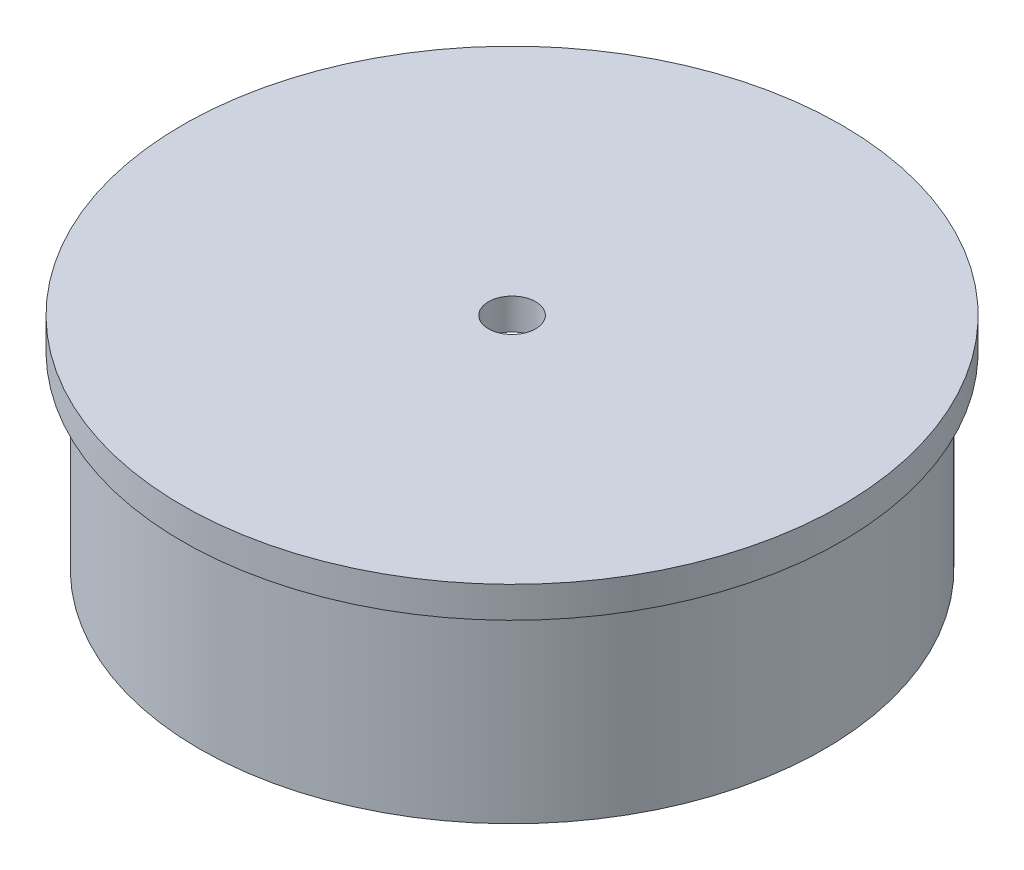
ISO-10303-21;
HEADER;
FILE_DESCRIPTION(('STEP AP214'),'2;1');
FILE_NAME('part.step','',(''),(''),'','','');
FILE_SCHEMA(('AUTOMOTIVE_DESIGN { 1 0 10303 214 1 1 1 1 }'));
ENDSEC;
DATA;
#1=APPLICATION_CONTEXT('core data for automotive mechanical design processes');
#2=APPLICATION_PROTOCOL_DEFINITION('international standard','automotive_design',2000,#1);
#3=PRODUCT_CONTEXT('',#1,'mechanical');
#4=PRODUCT('Part','Part','',(#3));
#5=PRODUCT_RELATED_PRODUCT_CATEGORY('part','',(#4));
#6=PRODUCT_DEFINITION_FORMATION('','',#4);
#7=PRODUCT_DEFINITION_CONTEXT('part definition',#1,'design');
#8=PRODUCT_DEFINITION('design','',#6,#7);
#9=PRODUCT_DEFINITION_SHAPE('','',#8);
#10=(LENGTH_UNIT() NAMED_UNIT(*) SI_UNIT(.MILLI.,.METRE.));
#11=(NAMED_UNIT(*) PLANE_ANGLE_UNIT() SI_UNIT($,.RADIAN.));
#12=(NAMED_UNIT(*) SI_UNIT($,.STERADIAN.) SOLID_ANGLE_UNIT());
#13=UNCERTAINTY_MEASURE_WITH_UNIT(LENGTH_MEASURE(1.E-05),#10,'distance_accuracy_value','');
#14=(GEOMETRIC_REPRESENTATION_CONTEXT(3) GLOBAL_UNCERTAINTY_ASSIGNED_CONTEXT((#13)) GLOBAL_UNIT_ASSIGNED_CONTEXT((#10,
#11,#12)) REPRESENTATION_CONTEXT('',''));
#15=CARTESIAN_POINT('',(0.,0.,0.));
#16=DIRECTION('',(0.,0.,1.));
#17=DIRECTION('',(1.,0.,0.));
#18=AXIS2_PLACEMENT_3D('',#15,#16,#17);
#19=CARTESIAN_POINT('',(1.5875,-2.1,0.));
#20=DIRECTION('',(0.,1.,0.));
#21=DIRECTION('',(0.,0.,1.));
#22=AXIS2_PLACEMENT_3D('',#19,#20,#21);
#23=PLANE('',#22);
#24=CARTESIAN_POINT('',(0.,-2.09999999999999,0.));
#25=DIRECTION('',(0.,-1.,0.));
#26=DIRECTION('',(0.,0.,-1.));
#27=AXIS2_PLACEMENT_3D('',#24,#25,#26);
#28=CIRCLE('',#27,1.5875);
#29=CARTESIAN_POINT('',(0.,-2.09999999999999,-1.5875));
#30=VERTEX_POINT('',#29);
#31=EDGE_CURVE('E64',#30,#30,#28,.T.);
#32=ORIENTED_EDGE('',*,*,#31,.F.);
#33=EDGE_LOOP('',(#32));
#34=FACE_BOUND('',#33,.T.);
#35=CARTESIAN_POINT('',(0.,-2.1,0.));
#36=DIRECTION('',(0.,-1.,0.));
#37=DIRECTION('',(0.,0.,-1.));
#38=AXIS2_PLACEMENT_3D('',#35,#36,#37);
#39=CIRCLE('',#38,17.4879);
#40=CARTESIAN_POINT('',(0.,-2.1,-17.4879));
#41=VERTEX_POINT('',#40);
#42=EDGE_CURVE('E61',#41,#41,#39,.T.);
#43=ORIENTED_EDGE('',*,*,#42,.T.);
#44=EDGE_LOOP('',(#43));
#45=FACE_BOUND('',#44,.T.);
#46=CARTESIAN_POINT('',(-4.70268180689715,-2.1,-9.525));
#47=DIRECTION('',(0.,1.,0.));
#48=DIRECTION('',(0.,0.,1.));
#49=AXIS2_PLACEMENT_3D('',#46,#47,#48);
#50=CIRCLE('',#49,3.65125);
#51=CARTESIAN_POINT('',(-4.70268180689715,-2.1,-5.87375));
#52=VERTEX_POINT('',#51);
#53=EDGE_CURVE('E47',#52,#52,#50,.T.);
#54=ORIENTED_EDGE('',*,*,#53,.T.);
#55=EDGE_LOOP('',(#54));
#56=FACE_BOUND('',#55,.T.);
#57=CARTESIAN_POINT('',(4.70268180689715,-2.1,-9.525));
#58=DIRECTION('',(0.,1.,0.));
#59=DIRECTION('',(0.,0.,1.));
#60=AXIS2_PLACEMENT_3D('',#57,#58,#59);
#61=CIRCLE('',#60,3.65125);
#62=CARTESIAN_POINT('',(4.70268180689715,-2.1,-5.87375));
#63=VERTEX_POINT('',#62);
#64=EDGE_CURVE('E43',#63,#63,#61,.T.);
#65=ORIENTED_EDGE('',*,*,#64,.T.);
#66=EDGE_LOOP('',(#65));
#67=FACE_BOUND('',#66,.T.);
#68=CARTESIAN_POINT('',(4.70268180689715,-2.1,9.525));
#69=DIRECTION('',(0.,1.,0.));
#70=DIRECTION('',(0.,0.,1.));
#71=AXIS2_PLACEMENT_3D('',#68,#69,#70);
#72=CIRCLE('',#71,2.38125);
#73=CARTESIAN_POINT('',(4.70268180689715,-2.1,11.90625));
#74=VERTEX_POINT('',#73);
#75=EDGE_CURVE('E92',#74,#74,#72,.T.);
#76=ORIENTED_EDGE('',*,*,#75,.T.);
#77=EDGE_LOOP('',(#76));
#78=FACE_BOUND('',#77,.T.);
#79=CARTESIAN_POINT('',(-4.70268180689715,-2.1,9.525));
#80=DIRECTION('',(0.,1.,0.));
#81=DIRECTION('',(0.,0.,1.));
#82=AXIS2_PLACEMENT_3D('',#79,#80,#81);
#83=CIRCLE('',#82,2.38125);
#84=CARTESIAN_POINT('',(-4.70268180689715,-2.1,11.90625));
#85=VERTEX_POINT('',#84);
#86=EDGE_CURVE('E10',#85,#85,#83,.F.);
#87=ORIENTED_EDGE('',*,*,#86,.F.);
#88=EDGE_LOOP('',(#87));
#89=FACE_BOUND('',#88,.T.);
#90=ADVANCED_FACE('F32',(#34,#45,#56,#67,#78,#89),#23,.F.);
#91=CARTESIAN_POINT('',(20.0279,-14.8,1.39854078212433E-13));
#92=DIRECTION('',(0.,1.,0.));
#93=DIRECTION('',(0.,0.,1.));
#94=AXIS2_PLACEMENT_3D('',#91,#92,#93);
#95=PLANE('',#94);
#96=CARTESIAN_POINT('',(0.,-14.8,0.));
#97=DIRECTION('',(0.,-1.,0.));
#98=DIRECTION('',(0.,0.,-1.));
#99=AXIS2_PLACEMENT_3D('',#96,#97,#98);
#100=CIRCLE('',#99,20.0279);
#101=CARTESIAN_POINT('',(0.,-14.8,-20.0279));
#102=VERTEX_POINT('',#101);
#103=EDGE_CURVE('E55',#102,#102,#100,.T.);
#104=ORIENTED_EDGE('',*,*,#103,.F.);
#105=EDGE_LOOP('',(#104));
#106=FACE_BOUND('',#105,.T.);
#107=CARTESIAN_POINT('',(0.,-14.8,0.));
#108=DIRECTION('',(0.,-1.,0.));
#109=DIRECTION('',(0.,0.,-1.));
#110=AXIS2_PLACEMENT_3D('',#107,#108,#109);
#111=CIRCLE('',#110,21.0693);
#112=CARTESIAN_POINT('',(0.,-14.8,-21.0693));
#113=VERTEX_POINT('',#112);
#114=EDGE_CURVE('E79',#113,#113,#111,.T.);
#115=ORIENTED_EDGE('',*,*,#114,.T.);
#116=EDGE_LOOP('',(#115));
#117=FACE_BOUND('',#116,.T.);
#118=ADVANCED_FACE('F117',(#106,#117),#95,.F.);
#119=CARTESIAN_POINT('',(0.,0.,0.));
#120=DIRECTION('',(0.,-1.,0.));
#121=DIRECTION('',(0.,0.,-1.));
#122=AXIS2_PLACEMENT_3D('',#119,#120,#121);
#123=CYLINDRICAL_SURFACE('',#122,20.0279);
#124=CARTESIAN_POINT('',(0.,-4.64,0.));
#125=DIRECTION('',(0.,-1.,0.));
#126=DIRECTION('',(0.,0.,-1.));
#127=AXIS2_PLACEMENT_3D('',#124,#125,#126);
#128=CIRCLE('',#127,20.0279);
#129=CARTESIAN_POINT('',(0.,-4.64,-20.0279));
#130=VERTEX_POINT('',#129);
#131=EDGE_CURVE('E58',#130,#130,#128,.T.);
#132=ORIENTED_EDGE('',*,*,#131,.F.);
#133=EDGE_LOOP('',(#132));
#134=FACE_BOUND('',#133,.T.);
#135=ORIENTED_EDGE('',*,*,#103,.T.);
#136=EDGE_LOOP('',(#135));
#137=FACE_BOUND('',#136,.T.);
#138=ADVANCED_FACE('F123',(#134,#137),#123,.F.);
#139=CARTESIAN_POINT('',(0.,-4.64,0.));
#140=DIRECTION('',(0.,-1.,0.));
#141=DIRECTION('',(0.,0.,-1.));
#142=AXIS2_PLACEMENT_3D('',#139,#140,#141);
#143=TOROIDAL_SURFACE('',#142,17.4879,2.54);
#144=ORIENTED_EDGE('',*,*,#42,.F.);
#145=EDGE_LOOP('',(#144));
#146=FACE_BOUND('',#145,.T.);
#147=ORIENTED_EDGE('',*,*,#131,.T.);
#148=EDGE_LOOP('',(#147));
#149=FACE_BOUND('',#148,.T.);
#150=ADVANCED_FACE('F132',(#146,#149),#143,.F.);
#151=CARTESIAN_POINT('',(0.,0.,0.));
#152=DIRECTION('',(0.,-1.,0.));
#153=DIRECTION('',(0.,0.,-1.));
#154=AXIS2_PLACEMENT_3D('',#151,#152,#153);
#155=CYLINDRICAL_SURFACE('',#154,1.5875);
#156=CARTESIAN_POINT('',(0.,0.,0.));
#157=DIRECTION('',(0.,-1.,0.));
#158=DIRECTION('',(0.,0.,-1.));
#159=AXIS2_PLACEMENT_3D('',#156,#157,#158);
#160=CIRCLE('',#159,1.5875);
#161=CARTESIAN_POINT('',(0.,0.,-1.5875));
#162=VERTEX_POINT('',#161);
#163=EDGE_CURVE('E67',#162,#162,#160,.T.);
#164=ORIENTED_EDGE('',*,*,#163,.F.);
#165=EDGE_LOOP('',(#164));
#166=FACE_BOUND('',#165,.T.);
#167=ORIENTED_EDGE('',*,*,#31,.T.);
#168=EDGE_LOOP('',(#167));
#169=FACE_BOUND('',#168,.T.);
#170=ADVANCED_FACE('F130',(#166,#169),#155,.F.);
#171=CARTESIAN_POINT('',(22.225,0.,1.55196345511577E-13));
#172=DIRECTION('',(0.,-1.,0.));
#173=DIRECTION('',(0.,0.,-1.));
#174=AXIS2_PLACEMENT_3D('',#171,#172,#173);
#175=PLANE('',#174);
#176=CARTESIAN_POINT('',(0.,0.,0.));
#177=DIRECTION('',(0.,-1.,0.));
#178=DIRECTION('',(0.,0.,-1.));
#179=AXIS2_PLACEMENT_3D('',#176,#177,#178);
#180=CIRCLE('',#179,22.225);
#181=CARTESIAN_POINT('',(0.,0.,-22.225));
#182=VERTEX_POINT('',#181);
#183=EDGE_CURVE('E70',#182,#182,#180,.T.);
#184=ORIENTED_EDGE('',*,*,#183,.F.);
#185=EDGE_LOOP('',(#184));
#186=FACE_BOUND('',#185,.T.);
#187=ORIENTED_EDGE('',*,*,#163,.T.);
#188=EDGE_LOOP('',(#187));
#189=FACE_BOUND('',#188,.T.);
#190=ADVANCED_FACE('F173',(#186,#189),#175,.F.);
#191=CARTESIAN_POINT('',(0.,0.,0.));
#192=DIRECTION('',(0.,-1.,0.));
#193=DIRECTION('',(0.,0.,-1.));
#194=AXIS2_PLACEMENT_3D('',#191,#192,#193);
#195=CYLINDRICAL_SURFACE('',#194,22.225);
#196=CARTESIAN_POINT('',(0.,-2.1,0.));
#197=DIRECTION('',(0.,-1.,0.));
#198=DIRECTION('',(0.,0.,-1.));
#199=AXIS2_PLACEMENT_3D('',#196,#197,#198);
#200=CIRCLE('',#199,22.225);
#201=CARTESIAN_POINT('',(0.,-2.1,-22.225));
#202=VERTEX_POINT('',#201);
#203=EDGE_CURVE('E73',#202,#202,#200,.T.);
#204=ORIENTED_EDGE('',*,*,#203,.F.);
#205=EDGE_LOOP('',(#204));
#206=FACE_BOUND('',#205,.T.);
#207=ORIENTED_EDGE('',*,*,#183,.T.);
#208=EDGE_LOOP('',(#207));
#209=FACE_BOUND('',#208,.T.);
#210=ADVANCED_FACE('F170',(#206,#209),#195,.T.);
#211=CARTESIAN_POINT('',(21.0693,-2.1,1.47126135544975E-13));
#212=DIRECTION('',(0.,1.,0.));
#213=DIRECTION('',(0.,0.,1.));
#214=AXIS2_PLACEMENT_3D('',#211,#212,#213);
#215=PLANE('',#214);
#216=CARTESIAN_POINT('',(0.,-2.1,0.));
#217=DIRECTION('',(0.,-1.,0.));
#218=DIRECTION('',(0.,0.,-1.));
#219=AXIS2_PLACEMENT_3D('',#216,#217,#218);
#220=CIRCLE('',#219,21.0693);
#221=CARTESIAN_POINT('',(0.,-2.1,-21.0693));
#222=VERTEX_POINT('',#221);
#223=EDGE_CURVE('E76',#222,#222,#220,.T.);
#224=ORIENTED_EDGE('',*,*,#223,.F.);
#225=EDGE_LOOP('',(#224));
#226=FACE_BOUND('',#225,.T.);
#227=ORIENTED_EDGE('',*,*,#203,.T.);
#228=EDGE_LOOP('',(#227));
#229=FACE_BOUND('',#228,.T.);
#230=ADVANCED_FACE('F164',(#226,#229),#215,.F.);
#231=CARTESIAN_POINT('',(0.,0.,0.));
#232=DIRECTION('',(0.,-1.,0.));
#233=DIRECTION('',(0.,0.,-1.));
#234=AXIS2_PLACEMENT_3D('',#231,#232,#233);
#235=CYLINDRICAL_SURFACE('',#234,21.0693);
#236=ORIENTED_EDGE('',*,*,#114,.F.);
#237=EDGE_LOOP('',(#236));
#238=FACE_BOUND('',#237,.T.);
#239=ORIENTED_EDGE('',*,*,#223,.T.);
#240=EDGE_LOOP('',(#239));
#241=FACE_BOUND('',#240,.T.);
#242=ADVANCED_FACE('F159',(#238,#241),#235,.T.);
#243=CARTESIAN_POINT('',(-4.70268180689715,-4.55516676711909,-9.525));
#244=DIRECTION('',(0.,1.,0.));
#245=DIRECTION('',(-1.,0.,0.));
#246=AXIS2_PLACEMENT_3D('',#243,#244,#245);
#247=CYLINDRICAL_SURFACE('',#246,2.38125);
#248=CARTESIAN_POINT('',(-4.70268180689715,-3.37,-9.525));
#249=DIRECTION('',(0.,1.,0.));
#250=DIRECTION('',(0.,0.,1.));
#251=AXIS2_PLACEMENT_3D('',#248,#249,#250);
#252=CIRCLE('',#251,2.38125);
#253=CARTESIAN_POINT('',(-4.70268180689715,-3.37,-7.14375));
#254=VERTEX_POINT('',#253);
#255=EDGE_CURVE('E39',#254,#254,#252,.F.);
#256=ORIENTED_EDGE('',*,*,#255,.T.);
#257=EDGE_LOOP('',(#256));
#258=FACE_BOUND('',#257,.T.);
#259=CARTESIAN_POINT('',(-4.70268180689715,-4.55516676711909,-9.525));
#260=DIRECTION('',(0.,1.,0.));
#261=DIRECTION('',(0.,0.,-1.));
#262=AXIS2_PLACEMENT_3D('',#259,#260,#261);
#263=CIRCLE('',#262,2.38125);
#264=CARTESIAN_POINT('',(-7.08393180689715,-4.55516676711909,-9.525));
#265=VERTEX_POINT('',#264);
#266=EDGE_CURVE('E82',#265,#265,#263,.T.);
#267=ORIENTED_EDGE('',*,*,#266,.T.);
#268=EDGE_LOOP('',(#267));
#269=FACE_BOUND('',#268,.T.);
#270=ADVANCED_FACE('F154',(#258,#269),#247,.T.);
#271=CARTESIAN_POINT('',(0.,-4.55516676711909,-9.525));
#272=DIRECTION('',(0.,0.,-1.));
#273=DIRECTION('',(-1.,0.,0.));
#274=AXIS2_PLACEMENT_3D('',#271,#272,#273);
#275=TOROIDAL_SURFACE('',#274,4.70268180689715,2.38125);
#276=CARTESIAN_POINT('',(4.70268180689715,-4.55516676711909,-9.525));
#277=DIRECTION('',(0.,-1.,0.));
#278=DIRECTION('',(0.,0.,-1.));
#279=AXIS2_PLACEMENT_3D('',#276,#277,#278);
#280=CIRCLE('',#279,2.38125);
#281=CARTESIAN_POINT('',(7.08393180689715,-4.55516676711909,-9.525));
#282=VERTEX_POINT('',#281);
#283=EDGE_CURVE('E85',#282,#282,#280,.T.);
#284=CARTESIAN_POINT('',(0.,-4.55516676711909,-9.525));
#285=DIRECTION('',(0.,0.,-1.));
#286=DIRECTION('',(-1.,0.,0.));
#287=AXIS2_PLACEMENT_3D('',#284,#285,#286);
#288=CIRCLE('',#287,7.08393180689715);
#289=EDGE_CURVE('',#282,#265,#288,.T.);
#290=ORIENTED_EDGE('',*,*,#283,.T.);
#291=ORIENTED_EDGE('',*,*,#266,.F.);
#292=ORIENTED_EDGE('',*,*,#289,.T.);
#293=ORIENTED_EDGE('',*,*,#289,.F.);
#294=EDGE_LOOP('',(#290,#292,#291,#293));
#295=FACE_BOUND('',#294,.T.);
#296=ADVANCED_FACE('F144',(#295),#275,.T.);
#297=CARTESIAN_POINT('',(4.70268180689715,-4.55516676711909,-9.525));
#298=DIRECTION('',(0.,1.,0.));
#299=DIRECTION('',(-1.,0.,0.));
#300=AXIS2_PLACEMENT_3D('',#297,#298,#299);
#301=CYLINDRICAL_SURFACE('',#300,2.38125);
#302=CARTESIAN_POINT('',(4.70268180689715,-3.37,-9.525));
#303=DIRECTION('',(0.,1.,0.));
#304=DIRECTION('',(0.,0.,1.));
#305=AXIS2_PLACEMENT_3D('',#302,#303,#304);
#306=CIRCLE('',#305,2.38125);
#307=CARTESIAN_POINT('',(4.70268180689715,-3.37,-7.14375));
#308=VERTEX_POINT('',#307);
#309=EDGE_CURVE('E52',#308,#308,#306,.F.);
#310=ORIENTED_EDGE('',*,*,#309,.T.);
#311=EDGE_LOOP('',(#310));
#312=FACE_BOUND('',#311,.T.);
#313=ORIENTED_EDGE('',*,*,#283,.F.);
#314=EDGE_LOOP('',(#313));
#315=FACE_BOUND('',#314,.T.);
#316=ADVANCED_FACE('F139',(#312,#315),#301,.T.);
#317=CARTESIAN_POINT('',(4.70268180689715,-3.37,-9.525));
#318=DIRECTION('',(0.,1.,0.));
#319=DIRECTION('',(0.,0.,1.));
#320=AXIS2_PLACEMENT_3D('',#317,#318,#319);
#321=TOROIDAL_SURFACE('',#320,3.65125,1.27);
#322=ORIENTED_EDGE('',*,*,#64,.F.);
#323=EDGE_LOOP('',(#322));
#324=FACE_BOUND('',#323,.T.);
#325=ORIENTED_EDGE('',*,*,#309,.F.);
#326=EDGE_LOOP('',(#325));
#327=FACE_BOUND('',#326,.T.);
#328=ADVANCED_FACE('F113',(#324,#327),#321,.F.);
#329=CARTESIAN_POINT('',(-4.70268180689715,-3.37,-9.525));
#330=DIRECTION('',(0.,1.,0.));
#331=DIRECTION('',(0.,0.,1.));
#332=AXIS2_PLACEMENT_3D('',#329,#330,#331);
#333=TOROIDAL_SURFACE('',#332,3.65125,1.27);
#334=ORIENTED_EDGE('',*,*,#255,.F.);
#335=EDGE_LOOP('',(#334));
#336=FACE_BOUND('',#335,.T.);
#337=ORIENTED_EDGE('',*,*,#53,.F.);
#338=EDGE_LOOP('',(#337));
#339=FACE_BOUND('',#338,.T.);
#340=ADVANCED_FACE('F34',(#336,#339),#333,.F.);
#341=CARTESIAN_POINT('',(-4.70268180689715,-4.55516676711902,9.525));
#342=DIRECTION('',(0.,1.,0.));
#343=DIRECTION('',(-1.,0.,0.));
#344=AXIS2_PLACEMENT_3D('',#341,#342,#343);
#345=CYLINDRICAL_SURFACE('',#344,2.38125);
#346=CARTESIAN_POINT('',(-4.70268180689715,-4.55516676711902,9.525));
#347=DIRECTION('',(0.,-1.,0.));
#348=DIRECTION('',(0.,0.,1.));
#349=AXIS2_PLACEMENT_3D('',#346,#347,#348);
#350=CIRCLE('',#349,2.38125);
#351=CARTESIAN_POINT('',(-7.08393180689715,-4.55516676711899,9.525));
#352=VERTEX_POINT('',#351);
#353=EDGE_CURVE('E88',#352,#352,#350,.T.);
#354=ORIENTED_EDGE('',*,*,#353,.F.);
#355=EDGE_LOOP('',(#354));
#356=FACE_BOUND('',#355,.T.);
#357=ORIENTED_EDGE('',*,*,#86,.T.);
#358=EDGE_LOOP('',(#357));
#359=FACE_BOUND('',#358,.T.);
#360=ADVANCED_FACE('F104',(#356,#359),#345,.T.);
#361=CARTESIAN_POINT('',(0.,-4.55516676711909,9.525));
#362=DIRECTION('',(0.,0.,-1.));
#363=DIRECTION('',(-1.,0.,0.));
#364=AXIS2_PLACEMENT_3D('',#361,#362,#363);
#365=TOROIDAL_SURFACE('',#364,4.70268180689715,2.38125);
#366=CARTESIAN_POINT('',(4.70268180689715,-4.55516676711909,9.525));
#367=DIRECTION('',(0.,1.,0.));
#368=DIRECTION('',(0.,0.,1.));
#369=AXIS2_PLACEMENT_3D('',#366,#367,#368);
#370=CIRCLE('',#369,2.38125);
#371=CARTESIAN_POINT('',(7.08393180689715,-4.55516676711909,9.525));
#372=VERTEX_POINT('',#371);
#373=EDGE_CURVE('E91',#372,#372,#370,.T.);
#374=CARTESIAN_POINT('',(0.,-4.55516676711909,9.525));
#375=DIRECTION('',(0.,0.,-1.));
#376=DIRECTION('',(-1.,0.,0.));
#377=AXIS2_PLACEMENT_3D('',#374,#375,#376);
#378=CIRCLE('',#377,7.08393180689715);
#379=EDGE_CURVE('',#372,#352,#378,.T.);
#380=ORIENTED_EDGE('',*,*,#373,.F.);
#381=ORIENTED_EDGE('',*,*,#353,.T.);
#382=ORIENTED_EDGE('',*,*,#379,.T.);
#383=ORIENTED_EDGE('',*,*,#379,.F.);
#384=EDGE_LOOP('',(#380,#382,#381,#383));
#385=FACE_BOUND('',#384,.T.);
#386=ADVANCED_FACE('F101',(#385),#365,.T.);
#387=CARTESIAN_POINT('',(4.70268180689715,-4.55516676711909,9.525));
#388=DIRECTION('',(0.,1.,0.));
#389=DIRECTION('',(-1.,0.,0.));
#390=AXIS2_PLACEMENT_3D('',#387,#388,#389);
#391=CYLINDRICAL_SURFACE('',#390,2.38125);
#392=ORIENTED_EDGE('',*,*,#373,.T.);
#393=EDGE_LOOP('',(#392));
#394=FACE_BOUND('',#393,.T.);
#395=ORIENTED_EDGE('',*,*,#75,.F.);
#396=EDGE_LOOP('',(#395));
#397=FACE_BOUND('',#396,.T.);
#398=ADVANCED_FACE('F98',(#394,#397),#391,.T.);
#399=CLOSED_SHELL('',(#90,#118,#138,#150,#170,#190,#210,#230,#242,#270,#296,#316,#328,#340,#360,
#386,#398));
#400=MANIFOLD_SOLID_BREP('B2',#399);
#401=ADVANCED_BREP_SHAPE_REPRESENTATION('',(#18,#400),#14);
#402=SHAPE_DEFINITION_REPRESENTATION(#9,#401);
ENDSEC;
END-ISO-10303-21;
